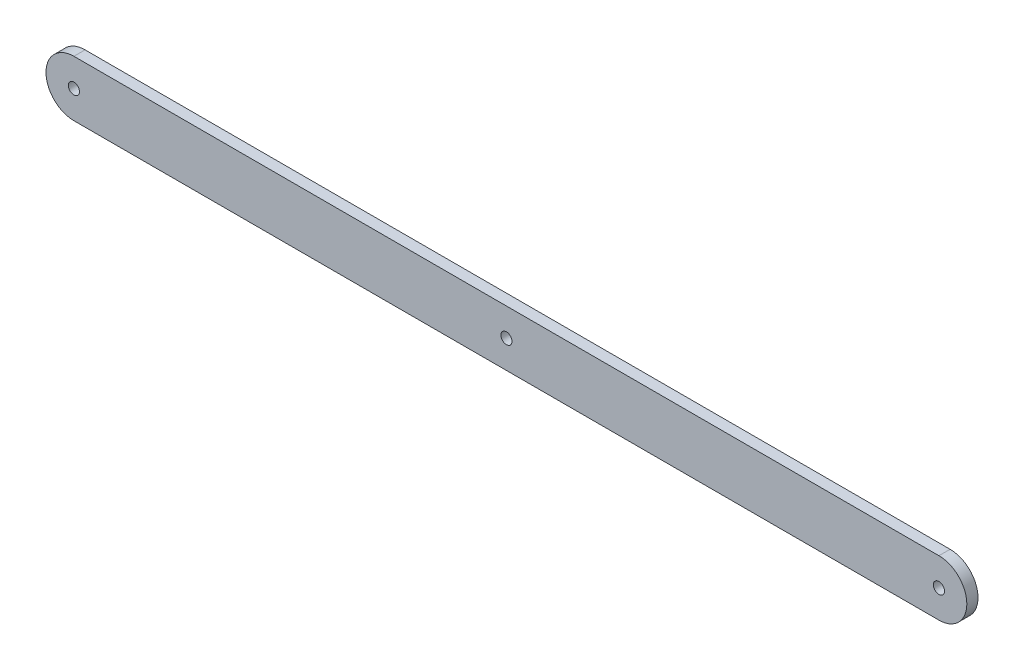
ISO-10303-21;
HEADER;
FILE_DESCRIPTION(('STEP AP214'),'2;1');
FILE_NAME('part.step','',(''),(''),'','','');
FILE_SCHEMA(('AUTOMOTIVE_DESIGN { 1 0 10303 214 1 1 1 1 }'));
ENDSEC;
DATA;
#1=APPLICATION_CONTEXT('core data for automotive mechanical design processes');
#2=APPLICATION_PROTOCOL_DEFINITION('international standard','automotive_design',2000,#1);
#3=PRODUCT_CONTEXT('',#1,'mechanical');
#4=PRODUCT('Part','Part','',(#3));
#5=PRODUCT_RELATED_PRODUCT_CATEGORY('part','',(#4));
#6=PRODUCT_DEFINITION_FORMATION('','',#4);
#7=PRODUCT_DEFINITION_CONTEXT('part definition',#1,'design');
#8=PRODUCT_DEFINITION('design','',#6,#7);
#9=PRODUCT_DEFINITION_SHAPE('','',#8);
#10=(LENGTH_UNIT() NAMED_UNIT(*) SI_UNIT(.MILLI.,.METRE.));
#11=(NAMED_UNIT(*) PLANE_ANGLE_UNIT() SI_UNIT($,.RADIAN.));
#12=(NAMED_UNIT(*) SI_UNIT($,.STERADIAN.) SOLID_ANGLE_UNIT());
#13=UNCERTAINTY_MEASURE_WITH_UNIT(LENGTH_MEASURE(1.E-05),#10,'distance_accuracy_value','');
#14=(GEOMETRIC_REPRESENTATION_CONTEXT(3) GLOBAL_UNCERTAINTY_ASSIGNED_CONTEXT((#13)) GLOBAL_UNIT_ASSIGNED_CONTEXT((#10,
#11,#12)) REPRESENTATION_CONTEXT('',''));
#15=CARTESIAN_POINT('',(0.,0.,0.));
#16=DIRECTION('',(0.,0.,1.));
#17=DIRECTION('',(1.,0.,0.));
#18=AXIS2_PLACEMENT_3D('',#15,#16,#17);
#19=CARTESIAN_POINT('',(-102.380952380952,27.9761904761905,4.));
#20=DIRECTION('',(0.,0.,1.));
#21=DIRECTION('',(1.,0.,0.));
#22=AXIS2_PLACEMENT_3D('',#19,#20,#21);
#23=PLANE('',#22);
#24=CARTESIAN_POINT('',(52.6190476190476,27.9761904761905,4.));
#25=DIRECTION('',(0.,0.,1.));
#26=DIRECTION('',(1.,0.,0.));
#27=AXIS2_PLACEMENT_3D('',#24,#25,#26);
#28=CIRCLE('',#27,2.);
#29=CARTESIAN_POINT('',(54.6190476190476,27.9761904761905,4.));
#30=VERTEX_POINT('',#29);
#31=EDGE_CURVE('E134',#30,#30,#28,.T.);
#32=ORIENTED_EDGE('',*,*,#31,.F.);
#33=EDGE_LOOP('',(#32));
#34=FACE_BOUND('',#33,.T.);
#35=CARTESIAN_POINT('',(-102.380952380952,27.9761904761905,4.));
#36=DIRECTION('',(0.,0.,1.));
#37=DIRECTION('',(1.,0.,0.));
#38=AXIS2_PLACEMENT_3D('',#35,#36,#37);
#39=CIRCLE('',#38,10.);
#40=CARTESIAN_POINT('',(-102.380952380952,37.9761904761905,4.));
#41=VERTEX_POINT('',#40);
#42=CARTESIAN_POINT('',(-102.380952380952,17.9761904761905,4.));
#43=VERTEX_POINT('',#42);
#44=EDGE_CURVE('E92',#41,#43,#39,.T.);
#45=ORIENTED_EDGE('',*,*,#44,.T.);
#46=DIRECTION('',(1.,0.,0.));
#47=VECTOR('',#46,1.);
#48=CARTESIAN_POINT('',(-102.380952380952,17.9761904761905,4.));
#49=LINE('',#48,#47);
#50=CARTESIAN_POINT('',(207.619047619048,17.9761904761905,4.));
#51=VERTEX_POINT('',#50);
#52=EDGE_CURVE('E87',#43,#51,#49,.T.);
#53=ORIENTED_EDGE('',*,*,#52,.T.);
#54=CARTESIAN_POINT('',(207.619047619048,27.9761904761905,4.));
#55=DIRECTION('',(0.,0.,1.));
#56=DIRECTION('',(1.,0.,0.));
#57=AXIS2_PLACEMENT_3D('',#54,#55,#56);
#58=CIRCLE('',#57,9.99999999999998);
#59=CARTESIAN_POINT('',(207.619047619048,37.9761904761904,4.));
#60=VERTEX_POINT('',#59);
#61=EDGE_CURVE('E90',#51,#60,#58,.T.);
#62=ORIENTED_EDGE('',*,*,#61,.T.);
#63=DIRECTION('',(-1.,0.,0.));
#64=VECTOR('',#63,1.);
#65=CARTESIAN_POINT('',(207.619047619048,37.9761904761904,4.));
#66=LINE('',#65,#64);
#67=EDGE_CURVE('E57',#60,#41,#66,.T.);
#68=ORIENTED_EDGE('',*,*,#67,.T.);
#69=EDGE_LOOP('',(#45,#53,#62,#68));
#70=FACE_BOUND('',#69,.T.);
#71=CARTESIAN_POINT('',(207.619047619048,27.9761904761905,4.));
#72=DIRECTION('',(0.,0.,1.));
#73=DIRECTION('',(1.,0.,0.));
#74=AXIS2_PLACEMENT_3D('',#71,#72,#73);
#75=CIRCLE('',#74,2.);
#76=CARTESIAN_POINT('',(209.619047619048,27.9761904761905,4.));
#77=VERTEX_POINT('',#76);
#78=EDGE_CURVE('E112',#77,#77,#75,.T.);
#79=ORIENTED_EDGE('',*,*,#78,.F.);
#80=EDGE_LOOP('',(#79));
#81=FACE_BOUND('',#80,.T.);
#82=CARTESIAN_POINT('',(-102.380952380952,27.9761904761905,4.));
#83=DIRECTION('',(0.,0.,1.));
#84=DIRECTION('',(1.,0.,0.));
#85=AXIS2_PLACEMENT_3D('',#82,#83,#84);
#86=CIRCLE('',#85,2.);
#87=CARTESIAN_POINT('',(-100.380952380952,27.9761904761905,4.));
#88=VERTEX_POINT('',#87);
#89=EDGE_CURVE('E142',#88,#88,#86,.T.);
#90=ORIENTED_EDGE('',*,*,#89,.F.);
#91=EDGE_LOOP('',(#90));
#92=FACE_BOUND('',#91,.T.);
#93=ADVANCED_FACE('F39',(#34,#70,#81,#92),#23,.T.);
#94=CARTESIAN_POINT('',(-102.380952380952,27.9761904761905,0.));
#95=DIRECTION('',(0.,0.,1.));
#96=DIRECTION('',(1.,0.,0.));
#97=AXIS2_PLACEMENT_3D('',#94,#95,#96);
#98=PLANE('',#97);
#99=CARTESIAN_POINT('',(-102.380952380952,27.9761904761905,0.));
#100=DIRECTION('',(0.,0.,1.));
#101=DIRECTION('',(1.,0.,0.));
#102=AXIS2_PLACEMENT_3D('',#99,#100,#101);
#103=CIRCLE('',#102,10.);
#104=CARTESIAN_POINT('',(-102.380952380952,37.9761904761905,0.));
#105=VERTEX_POINT('',#104);
#106=CARTESIAN_POINT('',(-102.380952380952,17.9761904761905,0.));
#107=VERTEX_POINT('',#106);
#108=EDGE_CURVE('E108',#105,#107,#103,.T.);
#109=ORIENTED_EDGE('',*,*,#108,.F.);
#110=DIRECTION('',(-1.,0.,0.));
#111=VECTOR('',#110,1.);
#112=CARTESIAN_POINT('',(207.619047619048,37.9761904761904,0.));
#113=LINE('',#112,#111);
#114=CARTESIAN_POINT('',(207.619047619048,37.9761904761904,0.));
#115=VERTEX_POINT('',#114);
#116=EDGE_CURVE('E80',#115,#105,#113,.T.);
#117=ORIENTED_EDGE('',*,*,#116,.F.);
#118=CARTESIAN_POINT('',(207.619047619048,27.9761904761905,0.));
#119=DIRECTION('',(0.,0.,1.));
#120=DIRECTION('',(1.,0.,0.));
#121=AXIS2_PLACEMENT_3D('',#118,#119,#120);
#122=CIRCLE('',#121,9.99999999999998);
#123=CARTESIAN_POINT('',(207.619047619048,17.9761904761905,0.));
#124=VERTEX_POINT('',#123);
#125=EDGE_CURVE('E74',#124,#115,#122,.T.);
#126=ORIENTED_EDGE('',*,*,#125,.F.);
#127=DIRECTION('',(1.,0.,0.));
#128=VECTOR('',#127,1.);
#129=CARTESIAN_POINT('',(-102.380952380952,17.9761904761905,0.));
#130=LINE('',#129,#128);
#131=EDGE_CURVE('E97',#107,#124,#130,.T.);
#132=ORIENTED_EDGE('',*,*,#131,.F.);
#133=EDGE_LOOP('',(#109,#117,#126,#132));
#134=FACE_BOUND('',#133,.T.);
#135=CARTESIAN_POINT('',(207.619047619048,27.9761904761905,0.));
#136=DIRECTION('',(0.,0.,1.));
#137=DIRECTION('',(1.,0.,0.));
#138=AXIS2_PLACEMENT_3D('',#135,#136,#137);
#139=CIRCLE('',#138,2.);
#140=CARTESIAN_POINT('',(209.619047619048,27.9761904761905,0.));
#141=VERTEX_POINT('',#140);
#142=EDGE_CURVE('E130',#141,#141,#139,.T.);
#143=ORIENTED_EDGE('',*,*,#142,.T.);
#144=EDGE_LOOP('',(#143));
#145=FACE_BOUND('',#144,.T.);
#146=CARTESIAN_POINT('',(52.6190476190476,27.9761904761905,0.));
#147=DIRECTION('',(0.,0.,1.));
#148=DIRECTION('',(1.,0.,0.));
#149=AXIS2_PLACEMENT_3D('',#146,#147,#148);
#150=CIRCLE('',#149,2.);
#151=CARTESIAN_POINT('',(54.6190476190476,27.9761904761905,0.));
#152=VERTEX_POINT('',#151);
#153=EDGE_CURVE('E138',#152,#152,#150,.T.);
#154=ORIENTED_EDGE('',*,*,#153,.T.);
#155=EDGE_LOOP('',(#154));
#156=FACE_BOUND('',#155,.T.);
#157=CARTESIAN_POINT('',(-102.380952380952,27.9761904761905,0.));
#158=DIRECTION('',(0.,0.,1.));
#159=DIRECTION('',(1.,0.,0.));
#160=AXIS2_PLACEMENT_3D('',#157,#158,#159);
#161=CIRCLE('',#160,2.);
#162=CARTESIAN_POINT('',(-100.380952380952,27.9761904761905,0.));
#163=VERTEX_POINT('',#162);
#164=EDGE_CURVE('E146',#163,#163,#161,.T.);
#165=ORIENTED_EDGE('',*,*,#164,.T.);
#166=EDGE_LOOP('',(#165));
#167=FACE_BOUND('',#166,.T.);
#168=ADVANCED_FACE('F125',(#134,#145,#156,#167),#98,.F.);
#169=CARTESIAN_POINT('',(-102.380952380952,27.9761904761905,4.));
#170=DIRECTION('',(0.,0.,-1.));
#171=DIRECTION('',(-1.,0.,0.));
#172=AXIS2_PLACEMENT_3D('',#169,#170,#171);
#173=CYLINDRICAL_SURFACE('',#172,10.);
#174=ORIENTED_EDGE('',*,*,#108,.T.);
#175=DIRECTION('',(0.,0.,-1.));
#176=VECTOR('',#175,1.);
#177=CARTESIAN_POINT('',(-102.380952380952,17.9761904761905,4.));
#178=LINE('',#177,#176);
#179=EDGE_CURVE('E11',#43,#107,#178,.T.);
#180=ORIENTED_EDGE('',*,*,#179,.F.);
#181=ORIENTED_EDGE('',*,*,#44,.F.);
#182=DIRECTION('',(0.,0.,-1.));
#183=VECTOR('',#182,1.);
#184=CARTESIAN_POINT('',(-102.380952380952,37.9761904761905,4.));
#185=LINE('',#184,#183);
#186=EDGE_CURVE('E104',#41,#105,#185,.T.);
#187=ORIENTED_EDGE('',*,*,#186,.T.);
#188=EDGE_LOOP('',(#174,#180,#181,#187));
#189=FACE_BOUND('',#188,.T.);
#190=ADVANCED_FACE('F41',(#189),#173,.T.);
#191=CARTESIAN_POINT('',(-102.380952380952,17.9761904761905,4.));
#192=DIRECTION('',(0.,1.,0.));
#193=DIRECTION('',(-1.,0.,0.));
#194=AXIS2_PLACEMENT_3D('',#191,#192,#193);
#195=PLANE('',#194);
#196=ORIENTED_EDGE('',*,*,#131,.T.);
#197=DIRECTION('',(0.,0.,-1.));
#198=VECTOR('',#197,1.);
#199=CARTESIAN_POINT('',(207.619047619048,17.9761904761905,4.));
#200=LINE('',#199,#198);
#201=EDGE_CURVE('E49',#51,#124,#200,.T.);
#202=ORIENTED_EDGE('',*,*,#201,.F.);
#203=ORIENTED_EDGE('',*,*,#52,.F.);
#204=ORIENTED_EDGE('',*,*,#179,.T.);
#205=EDGE_LOOP('',(#196,#202,#203,#204));
#206=FACE_BOUND('',#205,.T.);
#207=ADVANCED_FACE('F96',(#206),#195,.F.);
#208=CARTESIAN_POINT('',(207.619047619048,27.9761904761905,4.));
#209=DIRECTION('',(0.,0.,-1.));
#210=DIRECTION('',(-1.,0.,0.));
#211=AXIS2_PLACEMENT_3D('',#208,#209,#210);
#212=CYLINDRICAL_SURFACE('',#211,9.99999999999998);
#213=ORIENTED_EDGE('',*,*,#125,.T.);
#214=DIRECTION('',(0.,0.,-1.));
#215=VECTOR('',#214,1.);
#216=CARTESIAN_POINT('',(207.619047619048,37.9761904761904,4.));
#217=LINE('',#216,#215);
#218=EDGE_CURVE('E99',#60,#115,#217,.T.);
#219=ORIENTED_EDGE('',*,*,#218,.F.);
#220=ORIENTED_EDGE('',*,*,#61,.F.);
#221=ORIENTED_EDGE('',*,*,#201,.T.);
#222=EDGE_LOOP('',(#213,#219,#220,#221));
#223=FACE_BOUND('',#222,.T.);
#224=ADVANCED_FACE('F100',(#223),#212,.T.);
#225=CARTESIAN_POINT('',(207.619047619048,37.9761904761904,4.));
#226=DIRECTION('',(0.,-1.,0.));
#227=DIRECTION('',(1.,0.,0.));
#228=AXIS2_PLACEMENT_3D('',#225,#226,#227);
#229=PLANE('',#228);
#230=ORIENTED_EDGE('',*,*,#116,.T.);
#231=ORIENTED_EDGE('',*,*,#186,.F.);
#232=ORIENTED_EDGE('',*,*,#67,.F.);
#233=ORIENTED_EDGE('',*,*,#218,.T.);
#234=EDGE_LOOP('',(#230,#231,#232,#233));
#235=FACE_BOUND('',#234,.T.);
#236=ADVANCED_FACE('F122',(#235),#229,.F.);
#237=CARTESIAN_POINT('',(207.619047619048,27.9761904761905,4.));
#238=DIRECTION('',(0.,0.,-1.));
#239=DIRECTION('',(-1.,0.,0.));
#240=AXIS2_PLACEMENT_3D('',#237,#238,#239);
#241=CYLINDRICAL_SURFACE('',#240,2.);
#242=ORIENTED_EDGE('',*,*,#78,.T.);
#243=EDGE_LOOP('',(#242));
#244=FACE_BOUND('',#243,.T.);
#245=ORIENTED_EDGE('',*,*,#142,.F.);
#246=EDGE_LOOP('',(#245));
#247=FACE_BOUND('',#246,.T.);
#248=ADVANCED_FACE('F166',(#244,#247),#241,.F.);
#249=CARTESIAN_POINT('',(52.6190476190476,27.9761904761905,4.));
#250=DIRECTION('',(0.,0.,-1.));
#251=DIRECTION('',(-1.,0.,0.));
#252=AXIS2_PLACEMENT_3D('',#249,#250,#251);
#253=CYLINDRICAL_SURFACE('',#252,2.);
#254=ORIENTED_EDGE('',*,*,#31,.T.);
#255=EDGE_LOOP('',(#254));
#256=FACE_BOUND('',#255,.T.);
#257=ORIENTED_EDGE('',*,*,#153,.F.);
#258=EDGE_LOOP('',(#257));
#259=FACE_BOUND('',#258,.T.);
#260=ADVANCED_FACE('F212',(#256,#259),#253,.F.);
#261=CARTESIAN_POINT('',(-102.380952380952,27.9761904761905,4.));
#262=DIRECTION('',(0.,0.,-1.));
#263=DIRECTION('',(-1.,0.,0.));
#264=AXIS2_PLACEMENT_3D('',#261,#262,#263);
#265=CYLINDRICAL_SURFACE('',#264,2.);
#266=ORIENTED_EDGE('',*,*,#89,.T.);
#267=EDGE_LOOP('',(#266));
#268=FACE_BOUND('',#267,.T.);
#269=ORIENTED_EDGE('',*,*,#164,.F.);
#270=EDGE_LOOP('',(#269));
#271=FACE_BOUND('',#270,.T.);
#272=ADVANCED_FACE('F154',(#268,#271),#265,.F.);
#273=CLOSED_SHELL('',(#93,#168,#190,#207,#224,#236,#248,#260,#272));
#274=MANIFOLD_SOLID_BREP('B2',#273);
#275=ADVANCED_BREP_SHAPE_REPRESENTATION('',(#18,#274),#14);
#276=SHAPE_DEFINITION_REPRESENTATION(#9,#275);
ENDSEC;
END-ISO-10303-21;
